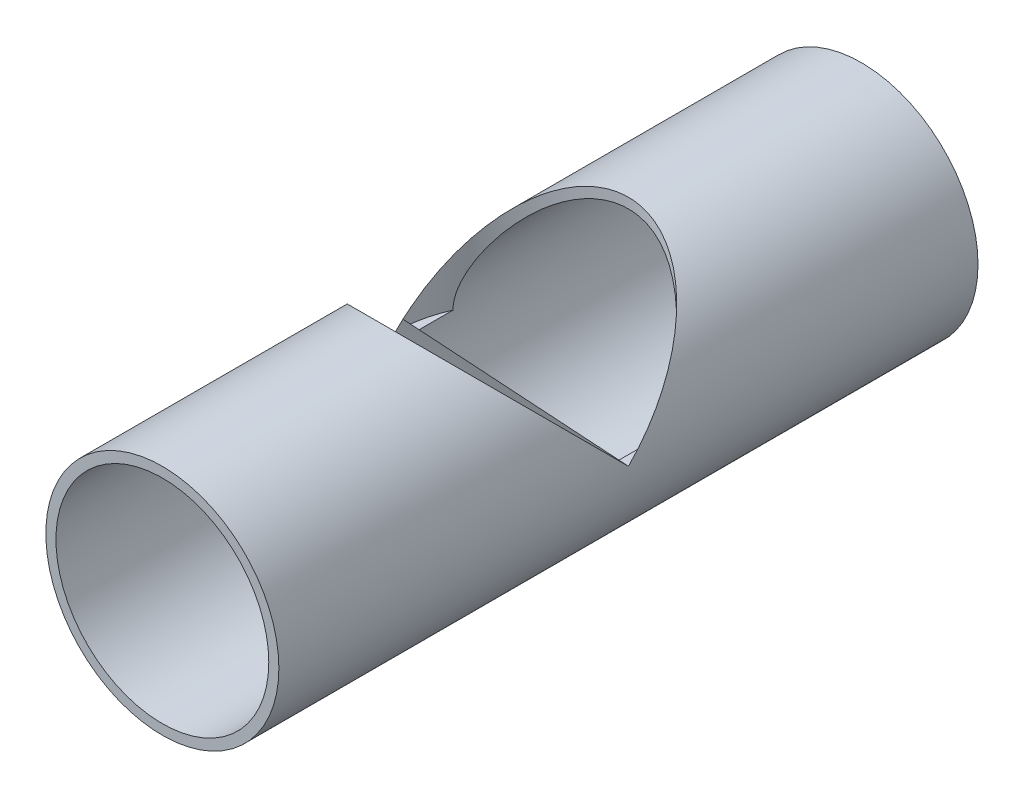
ISO-10303-21;
HEADER;
FILE_DESCRIPTION(('STEP AP214'),'2;1');
FILE_NAME('part.step','',(''),(''),'','','');
FILE_SCHEMA(('AUTOMOTIVE_DESIGN { 1 0 10303 214 1 1 1 1 }'));
ENDSEC;
DATA;
#1=APPLICATION_CONTEXT('core data for automotive mechanical design processes');
#2=APPLICATION_PROTOCOL_DEFINITION('international standard','automotive_design',2000,#1);
#3=PRODUCT_CONTEXT('',#1,'mechanical');
#4=PRODUCT('Part','Part','',(#3));
#5=PRODUCT_RELATED_PRODUCT_CATEGORY('part','',(#4));
#6=PRODUCT_DEFINITION_FORMATION('','',#4);
#7=PRODUCT_DEFINITION_CONTEXT('part definition',#1,'design');
#8=PRODUCT_DEFINITION('design','',#6,#7);
#9=PRODUCT_DEFINITION_SHAPE('','',#8);
#10=(LENGTH_UNIT() NAMED_UNIT(*) SI_UNIT(.MILLI.,.METRE.));
#11=(NAMED_UNIT(*) PLANE_ANGLE_UNIT() SI_UNIT($,.RADIAN.));
#12=(NAMED_UNIT(*) SI_UNIT($,.STERADIAN.) SOLID_ANGLE_UNIT());
#13=UNCERTAINTY_MEASURE_WITH_UNIT(LENGTH_MEASURE(1.E-05),#10,'distance_accuracy_value','');
#14=(GEOMETRIC_REPRESENTATION_CONTEXT(3) GLOBAL_UNCERTAINTY_ASSIGNED_CONTEXT((#13)) GLOBAL_UNIT_ASSIGNED_CONTEXT((#10,
#11,#12)) REPRESENTATION_CONTEXT('',''));
#15=CARTESIAN_POINT('',(0.,0.,0.));
#16=DIRECTION('',(0.,0.,1.));
#17=DIRECTION('',(1.,0.,0.));
#18=AXIS2_PLACEMENT_3D('',#15,#16,#17);
#19=CARTESIAN_POINT('',(0.,0.,57.15));
#20=DIRECTION('',(0.,-1.,0.));
#21=DIRECTION('',(0.,0.,-1.));
#22=AXIS2_PLACEMENT_3D('',#19,#20,#21);
#23=PLANE('',#22);
#24=CARTESIAN_POINT('',(0.,0.,57.15));
#25=DIRECTION('',(0.,1.,0.));
#26=DIRECTION('',(0.,0.,1.));
#27=AXIS2_PLACEMENT_3D('',#24,#25,#26);
#28=CIRCLE('',#27,19.05);
#29=CARTESIAN_POINT('',(-17.399,0.,49.3925971485297));
#30=VERTEX_POINT('',#29);
#31=CARTESIAN_POINT('',(-19.05,0.,57.15));
#32=VERTEX_POINT('',#31);
#33=EDGE_CURVE('E34',#30,#32,#28,.T.);
#34=ORIENTED_EDGE('',*,*,#33,.T.);
#35=CARTESIAN_POINT('',(0.,0.,57.15));
#36=DIRECTION('',(0.,1.,0.));
#37=DIRECTION('',(0.,0.,1.));
#38=AXIS2_PLACEMENT_3D('',#35,#36,#37);
#39=CIRCLE('',#38,19.05);
#40=CARTESIAN_POINT('',(-17.399,0.,64.9074028514703));
#41=VERTEX_POINT('',#40);
#42=EDGE_CURVE('E67',#32,#41,#39,.T.);
#43=ORIENTED_EDGE('',*,*,#42,.T.);
#44=DIRECTION('',(0.,0.,1.));
#45=VECTOR('',#44,1.);
#46=CARTESIAN_POINT('',(-17.399,0.,0.));
#47=LINE('',#46,#45);
#48=EDGE_CURVE('E59',#41,#30,#47,.F.);
#49=ORIENTED_EDGE('',*,*,#48,.T.);
#50=EDGE_LOOP('',(#34,#43,#49));
#51=FACE_BOUND('',#50,.T.);
#52=ADVANCED_FACE('F17',(#51),#23,.F.);
#53=CARTESIAN_POINT('',(0.,0.,57.15));
#54=DIRECTION('',(0.,-1.,0.));
#55=DIRECTION('',(0.,0.,-1.));
#56=AXIS2_PLACEMENT_3D('',#53,#54,#55);
#57=PLANE('',#56);
#58=CARTESIAN_POINT('',(0.,0.,57.15));
#59=DIRECTION('',(0.,1.,0.));
#60=DIRECTION('',(0.,0.,1.));
#61=AXIS2_PLACEMENT_3D('',#58,#59,#60);
#62=CIRCLE('',#61,19.05);
#63=CARTESIAN_POINT('',(17.399,0.,64.9074028514703));
#64=VERTEX_POINT('',#63);
#65=CARTESIAN_POINT('',(19.05,0.,57.15));
#66=VERTEX_POINT('',#65);
#67=EDGE_CURVE('E52',#64,#66,#62,.T.);
#68=ORIENTED_EDGE('',*,*,#67,.T.);
#69=CARTESIAN_POINT('',(0.,0.,57.15));
#70=DIRECTION('',(0.,1.,0.));
#71=DIRECTION('',(0.,0.,1.));
#72=AXIS2_PLACEMENT_3D('',#69,#70,#71);
#73=CIRCLE('',#72,19.05);
#74=CARTESIAN_POINT('',(17.399,0.,49.3925971485297));
#75=VERTEX_POINT('',#74);
#76=EDGE_CURVE('E55',#66,#75,#73,.T.);
#77=ORIENTED_EDGE('',*,*,#76,.T.);
#78=DIRECTION('',(0.,0.,1.));
#79=VECTOR('',#78,1.);
#80=CARTESIAN_POINT('',(17.399,0.,0.));
#81=LINE('',#80,#79);
#82=EDGE_CURVE('E48',#75,#64,#81,.T.);
#83=ORIENTED_EDGE('',*,*,#82,.T.);
#84=EDGE_LOOP('',(#68,#77,#83));
#85=FACE_BOUND('',#84,.T.);
#86=ADVANCED_FACE('F50',(#85),#57,.F.);
#87=CARTESIAN_POINT('',(0.,0.,0.));
#88=DIRECTION('',(0.,0.,1.));
#89=DIRECTION('',(1.,0.,0.));
#90=AXIS2_PLACEMENT_3D('',#87,#88,#89);
#91=CYLINDRICAL_SURFACE('',#90,17.399);
#92=CARTESIAN_POINT('',(0.,0.,0.));
#93=DIRECTION('',(0.,0.,1.));
#94=DIRECTION('',(1.,0.,0.));
#95=AXIS2_PLACEMENT_3D('',#92,#93,#94);
#96=CIRCLE('',#95,17.399);
#97=CARTESIAN_POINT('',(17.399,0.,0.));
#98=VERTEX_POINT('',#97);
#99=EDGE_CURVE('E115',#98,#98,#96,.T.);
#100=ORIENTED_EDGE('',*,*,#99,.F.);
#101=EDGE_LOOP('',(#100));
#102=FACE_BOUND('',#101,.T.);
#103=ORIENTED_EDGE('',*,*,#48,.F.);
#104=CARTESIAN_POINT('',(-17.399,0.,64.9074028514703));
#105=CARTESIAN_POINT('',(-17.3990027926557,0.126619411653412,64.9073892806763));
#106=CARTESIAN_POINT('',(-17.3976172953479,0.253213422142252,64.91050481767));
#107=CARTESIAN_POINT('',(-17.3920993093259,0.506011561056938,64.9228663106787));
#108=CARTESIAN_POINT('',(-17.3879674951789,0.632215777580591,64.9321107612707));
#109=CARTESIAN_POINT('',(-17.3715310393773,1.00902330778525,64.9687698671014));
#110=CARTESIAN_POINT('',(-17.3551849725285,1.25863541656879,65.005111937121));
#111=CARTESIAN_POINT('',(-17.3126787054344,1.74803233786395,65.0983443626753));
#112=CARTESIAN_POINT('',(-17.2867118539878,1.98791378893045,65.1548291232535));
#113=CARTESIAN_POINT('',(-17.2256220476168,2.4617617860572,65.2854561488629));
#114=CARTESIAN_POINT('',(-17.1904915826852,2.69572330712606,65.3596128925784));
#115=CARTESIAN_POINT('',(-17.0914704002142,3.27608545997221,65.5644416491115));
#116=CARTESIAN_POINT('',(-17.0220928683165,3.6182148201961,65.7045314532728));
#117=CARTESIAN_POINT('',(-16.8659507450822,4.2875618159471,66.008409139202));
#118=CARTESIAN_POINT('',(-16.7791763237468,4.6147708919803,66.1722104043654));
#119=CARTESIAN_POINT('',(-16.5885907607409,5.25908025866418,66.5180621575718));
#120=CARTESIAN_POINT('',(-16.4846028375362,5.57602990071133,66.7002934483331));
#121=CARTESIAN_POINT('',(-16.2611162606568,6.19761374754541,67.0760481170756));
#122=CARTESIAN_POINT('',(-16.1416117153161,6.50224321644266,67.2695757688457));
#123=CARTESIAN_POINT('',(-15.9012328343761,7.0682446326165,67.6427199440383));
#124=CARTESIAN_POINT('',(-15.7818795075659,7.33075234639333,67.8216028930283));
#125=CARTESIAN_POINT('',(-15.531375280231,7.84755054304734,68.1830066315397));
#126=CARTESIAN_POINT('',(-15.4002228366692,8.10183994524195,68.3655278944272));
#127=CARTESIAN_POINT('',(-15.1261173325553,8.60275103720113,68.7325543909568));
#128=CARTESIAN_POINT('',(-14.9831580377589,8.84936858024162,68.9170606274058));
#129=CARTESIAN_POINT('',(-14.6854749405307,9.33504840785214,69.2865419716062));
#130=CARTESIAN_POINT('',(-14.5307500246226,9.57410997430043,69.4715171221294));
#131=CARTESIAN_POINT('',(-14.0499414824725,10.2784757466186,70.023976753931));
#132=CARTESIAN_POINT('',(-13.706221982577,10.7327911450247,70.3903569500405));
#133=CARTESIAN_POINT('',(-12.9709988366539,11.6105902831832,71.1114056628348));
#134=CARTESIAN_POINT('',(-12.5795204493307,12.0340901330639,71.4660802453506));
#135=CARTESIAN_POINT('',(-11.8513027830295,12.7460780346226,72.0702493412787));
#136=CARTESIAN_POINT('',(-11.5252152004648,13.0419213680792,72.32393857843));
#137=CARTESIAN_POINT('',(-10.8451357651757,13.6126880208168,72.8172254345686));
#138=CARTESIAN_POINT('',(-10.4911442114866,13.8876115642246,73.0568232045201));
#139=CARTESIAN_POINT('',(-9.7556464324253,14.4137713143204,73.5182053590736));
#140=CARTESIAN_POINT('',(-9.37416774185507,14.6650306596365,73.7400071123435));
#141=CARTESIAN_POINT('',(-8.58390774378864,15.1411487148883,74.1623369264844));
#142=CARTESIAN_POINT('',(-8.17513251731963,15.3660132743823,74.3628696999896));
#143=CARTESIAN_POINT('',(-7.41609675759786,15.7438449488538,74.7010787980119));
#144=CARTESIAN_POINT('',(-7.07052907343838,15.9021892450143,74.8432976749746));
#145=CARTESIAN_POINT('',(-6.36382451687045,16.1979501260028,75.1095864108884));
#146=CARTESIAN_POINT('',(-6.00269106933714,16.3353712846128,75.2336602360993));
#147=CARTESIAN_POINT('',(-5.26647789377184,16.5873660705375,75.4616118596446));
#148=CARTESIAN_POINT('',(-4.89140366751787,16.7019485999545,75.5654975265765));
#149=CARTESIAN_POINT('',(-4.12923028647436,16.9065171053999,75.751230625274));
#150=CARTESIAN_POINT('',(-3.74213100127715,16.9965028145804,75.8330778179467));
#151=CARTESIAN_POINT('',(-2.95593537190508,17.1507769807365,75.9735337773239));
#152=CARTESIAN_POINT('',(-2.55677683000924,17.2148923872178,76.0319860313285));
#153=CARTESIAN_POINT('',(-1.75207798329658,17.3153056168189,76.1235785556383));
#154=CARTESIAN_POINT('',(-1.34653766138736,17.3516033654214,76.1567187581382));
#155=CARTESIAN_POINT('',(-0.532740871466237,17.3956140232931,76.1969054092446));
#156=CARTESIAN_POINT('',(-0.124485289769641,17.4033358417348,76.2039599906146));
#157=CARTESIAN_POINT('',(0.691145635542898,17.3900500247943,76.1918258138202));
#158=CARTESIAN_POINT('',(1.09852104488591,17.3690446145166,76.17263908821));
#159=CARTESIAN_POINT('',(1.86650740664488,17.3024305274246,76.1118364386318));
#160=CARTESIAN_POINT('',(2.22756908470294,17.2596128163397,76.0727652631555));
#161=CARTESIAN_POINT('',(2.94361664813322,17.1520079260685,75.9746695916722));
#162=CARTESIAN_POINT('',(3.2986030444039,17.0872226038712,75.9156467822389));
#163=CARTESIAN_POINT('',(4.00038341779028,16.9366748894927,75.7786682489914));
#164=CARTESIAN_POINT('',(4.34717668373007,16.8509106835957,75.700710888207));
#165=CARTESIAN_POINT('',(5.03073264287059,16.65961931318,75.5271216594109));
#166=CARTESIAN_POINT('',(5.36749474073483,16.5540909783843,75.4314887447959));
#167=CARTESIAN_POINT('',(6.04508836894759,16.319211609248,75.2190712727942));
#168=CARTESIAN_POINT('',(6.38536566225002,16.1889732182397,75.1015031398445));
#169=CARTESIAN_POINT('',(7.05200979717744,15.9099012910429,74.8502421296737));
#170=CARTESIAN_POINT('',(7.37837661185775,15.7610677188377,74.7165492212207));
#171=CARTESIAN_POINT('',(8.01637955747604,15.4463398391999,74.4347274052077));
#172=CARTESIAN_POINT('',(8.32801263159099,15.2804420139058,74.2865955213283));
#173=CARTESIAN_POINT('',(8.93593865373799,14.9330779736276,73.9775912941988));
#174=CARTESIAN_POINT('',(9.23222831724047,14.751608447154,73.8167162415391));
#175=CARTESIAN_POINT('',(9.96108070114769,14.2751141336036,73.39616265681));
#176=CARTESIAN_POINT('',(10.3832304302346,13.9706188807904,73.1290705087056));
#177=CARTESIAN_POINT('',(11.1906483352997,13.3326512383542,72.5743967388524));
#178=CARTESIAN_POINT('',(11.5758996118658,12.9991657033674,72.2868058328948));
#179=CARTESIAN_POINT('',(12.3107246973626,12.3055766392129,71.6954983316236));
#180=CARTESIAN_POINT('',(12.6601983724747,11.9454030182208,71.3917399093147));
#181=CARTESIAN_POINT('',(13.3228256699068,11.2015895641249,70.7738744147983));
#182=CARTESIAN_POINT('',(13.6359864105728,10.8179543527437,70.4597693863683));
#183=CARTESIAN_POINT('',(14.2338486111263,10.0188698517803,69.8187294700677));
#184=CARTESIAN_POINT('',(14.517686463156,9.60287793519724,69.4916676006417));
#185=CARTESIAN_POINT('',(15.0487827113267,8.74718214020968,68.838186754623));
#186=CARTESIAN_POINT('',(15.296023432836,8.30746694358544,68.5117681633014));
#187=CARTESIAN_POINT('',(15.6391176739874,7.6293606590487,68.0293160856903));
#188=CARTESIAN_POINT('',(15.7488029782035,7.40036468575161,67.869778727444));
#189=CARTESIAN_POINT('',(15.9589029321096,6.9356804418858,67.5544108647403));
#190=CARTESIAN_POINT('',(16.0593187405627,6.69999301263363,67.3985798987662));
#191=CARTESIAN_POINT('',(16.25064002581,6.22159236078595,67.0924221698046));
#192=CARTESIAN_POINT('',(16.3415534376162,5.97888521981352,66.9420908835962));
#193=CARTESIAN_POINT('',(16.5136633013956,5.48564865833397,66.6489623035712));
#194=CARTESIAN_POINT('',(16.5948621460068,5.23512118317328,66.5061631594989));
#195=CARTESIAN_POINT('',(16.7399044598348,4.74960595279282,66.2438654480011));
#196=CARTESIAN_POINT('',(16.8046633839798,4.51539494834859,66.1234411407302));
#197=CARTESIAN_POINT('',(16.9253972886873,4.03935876063698,65.8935847674936));
#198=CARTESIAN_POINT('',(16.981371807116,3.79753317758156,65.784153279952));
#199=CARTESIAN_POINT('',(17.0835577011958,3.30749209621931,65.5801538563993));
#200=CARTESIAN_POINT('',(17.1298288043977,3.05932691299981,65.4854959663158));
#201=CARTESIAN_POINT('',(17.2122316312634,2.55526916443492,65.3139853899444));
#202=CARTESIAN_POINT('',(17.2483680118588,2.29938020825195,65.2371245287159));
#203=CARTESIAN_POINT('',(17.2984619179857,1.87510757973664,65.1292141352051));
#204=CARTESIAN_POINT('',(17.3157056836072,1.70875077851934,65.0916704239793));
#205=CARTESIAN_POINT('',(17.3454986249527,1.37373521286453,65.0263862190104));
#206=CARTESIAN_POINT('',(17.35804919276,1.20507714643118,64.9986428184619));
#207=CARTESIAN_POINT('',(17.3783689967595,0.86423619591593,64.9535535854909));
#208=CARTESIAN_POINT('',(17.386085725966,0.692034904492633,64.9363219871161));
#209=CARTESIAN_POINT('',(17.3964114605965,0.34656692612635,64.9132082062703));
#210=CARTESIAN_POINT('',(17.3990157927525,0.173299409508221,64.9073364079205));
#211=CARTESIAN_POINT('',(17.399,0.,64.9074028514704));
#212=B_SPLINE_CURVE_WITH_KNOTS('',3,(#104,#105,#106,#107,#108,#109,#110,#111,#112,#113,#114,
#115,#116,#117,#118,#119,#120,#121,#122,#123,#124,#125,#126,#127,#128,#129,#130,#131,#132,#133,
#134,#135,#136,#137,#138,#139,#140,#141,#142,#143,#144,#145,#146,#147,#148,#149,#150,#151,#152,
#153,#154,#155,#156,#157,#158,#159,#160,#161,#162,#163,#164,#165,#166,#167,#168,#169,#170,#171,
#172,#173,#174,#175,#176,#177,#178,#179,#180,#181,#182,#183,#184,#185,#186,#187,#188,#189,#190,
#191,#192,#193,#194,#195,#196,#197,#198,#199,#200,#201,#202,#203,#204,#205,#206,#207,#208,#209,
#210,#211),.UNSPECIFIED.,.F.,.F.,(4,2,2,2,2,2,2,2,2,2,2,2,2,2,2,2,2,2,2,2,2,2,2,2,2,2,2,2,2,2,2,
2,2,2,2,2,2,2,2,2,2,2,2,2,2,2,2,2,2,2,2,2,2,4),(0.,0.379764092853833,0.759434940165909,
1.51634726991587,2.25880724087371,3.00187761458816,4.12835037763912,5.25546144985719,
6.3949616034871,7.53489569789875,8.55259337985784,9.57042434587642,10.5887962249633,
11.6072646010801,13.6367495933949,15.6651658480776,17.1883664070907,18.71155064481,
20.2332297195439,21.754570923617,22.9709961355442,24.187155054878,25.4028390055058,
26.6185361444175,27.8422355786928,29.0659382909752,30.2892594549617,31.5124858703965,
32.608284333679,33.7039901888642,34.7997908060849,35.8956563285599,37.043090764153,
38.1905274222329,39.3382011047017,40.4861194600479,42.2386035757021,43.991886525206,
45.749949583538,47.5076674278728,49.3075787665061,51.1083565581974,52.0077767250255,
52.9070843042516,53.8056348105301,54.7039635517724,55.5171752742101,56.3304297641096,
57.1385211097759,57.9462405247013,58.4601584642904,58.9739238458356,59.4931773421597,
60.0129052701034),.UNSPECIFIED.);
#213=EDGE_CURVE('E63',#41,#64,#212,.T.);
#214=ORIENTED_EDGE('',*,*,#213,.T.);
#215=ORIENTED_EDGE('',*,*,#82,.F.);
#216=CARTESIAN_POINT('',(17.399,0.,49.3925971485297));
#217=CARTESIAN_POINT('',(17.3990027926557,0.12661941165341,49.3926107193237));
#218=CARTESIAN_POINT('',(17.3976172953479,0.25321342214225,49.38949518233));
#219=CARTESIAN_POINT('',(17.3920993093259,0.506011561056936,49.3771336893213));
#220=CARTESIAN_POINT('',(17.3879674951789,0.632215777580588,49.3678892387293));
#221=CARTESIAN_POINT('',(17.3715310393773,1.00902330778525,49.3312301328986));
#222=CARTESIAN_POINT('',(17.3551849725285,1.25863541656879,49.294888062879));
#223=CARTESIAN_POINT('',(17.3126787054344,1.74803233786395,49.2016556373247));
#224=CARTESIAN_POINT('',(17.2867118539878,1.98791378893046,49.1451708767465));
#225=CARTESIAN_POINT('',(17.2256220476168,2.4617617860572,49.0145438511371));
#226=CARTESIAN_POINT('',(17.1904915826852,2.69572330712607,48.9403871074216));
#227=CARTESIAN_POINT('',(17.0914704002142,3.2760854599722,48.7355583508885));
#228=CARTESIAN_POINT('',(17.0220928683165,3.6182148201961,48.5954685467272));
#229=CARTESIAN_POINT('',(16.8659507450822,4.28756181594711,48.291590860798));
#230=CARTESIAN_POINT('',(16.7791763237468,4.6147708919803,48.1277895956346));
#231=CARTESIAN_POINT('',(16.5885907607409,5.25908025866418,47.7819378424282));
#232=CARTESIAN_POINT('',(16.4846028375362,5.57602990071133,47.5997065516669));
#233=CARTESIAN_POINT('',(16.2611162606568,6.19761374754541,47.2239518829244));
#234=CARTESIAN_POINT('',(16.1416117153161,6.50224321644265,47.0304242311543));
#235=CARTESIAN_POINT('',(15.9012328343761,7.06824463261649,46.6572800559617));
#236=CARTESIAN_POINT('',(15.7818795075659,7.33075234639333,46.4783971069717));
#237=CARTESIAN_POINT('',(15.531375280231,7.84755054304734,46.1169933684603));
#238=CARTESIAN_POINT('',(15.4002228366692,8.10183994524193,45.9344721055728));
#239=CARTESIAN_POINT('',(15.1261173325553,8.60275103720112,45.5674456090432));
#240=CARTESIAN_POINT('',(14.9831580377589,8.84936858024161,45.3829393725942));
#241=CARTESIAN_POINT('',(14.6854749405307,9.33504840785213,45.0134580283939));
#242=CARTESIAN_POINT('',(14.5307500246226,9.57410997430042,44.8284828778707));
#243=CARTESIAN_POINT('',(14.0499414824725,10.2784757466186,44.276023246069));
#244=CARTESIAN_POINT('',(13.706221982577,10.7327911450247,43.9096430499595));
#245=CARTESIAN_POINT('',(12.9709988366539,11.6105902831832,43.1885943371652));
#246=CARTESIAN_POINT('',(12.5795204493307,12.0340901330639,42.8339197546494));
#247=CARTESIAN_POINT('',(11.8513027830295,12.7460780346226,42.2297506587214));
#248=CARTESIAN_POINT('',(11.5252152004648,13.0419213680792,41.97606142157));
#249=CARTESIAN_POINT('',(10.8451357651757,13.6126880208168,41.4827745654314));
#250=CARTESIAN_POINT('',(10.4911442114866,13.8876115642246,41.2431767954799));
#251=CARTESIAN_POINT('',(9.7556464324253,14.4137713143204,40.7817946409264));
#252=CARTESIAN_POINT('',(9.37416774185507,14.6650306596365,40.5599928876565));
#253=CARTESIAN_POINT('',(8.58390774378864,15.1411487148883,40.1376630735156));
#254=CARTESIAN_POINT('',(8.17513251731962,15.3660132743823,39.9371303000104));
#255=CARTESIAN_POINT('',(7.41609675759786,15.7438449488538,39.5989212019881));
#256=CARTESIAN_POINT('',(7.07052907343837,15.9021892450143,39.4567023250254));
#257=CARTESIAN_POINT('',(6.36382451687044,16.1979501260028,39.1904135891116));
#258=CARTESIAN_POINT('',(6.00269106933713,16.3353712846128,39.0663397639007));
#259=CARTESIAN_POINT('',(5.26647789377183,16.5873660705375,38.8383881403555));
#260=CARTESIAN_POINT('',(4.89140366751786,16.7019485999545,38.7345024734235));
#261=CARTESIAN_POINT('',(4.12923028647435,16.9065171053999,38.548769374726));
#262=CARTESIAN_POINT('',(3.74213100127715,16.9965028145804,38.4669221820533));
#263=CARTESIAN_POINT('',(2.95593537190507,17.1507769807365,38.3264662226761));
#264=CARTESIAN_POINT('',(2.55677683000923,17.2148923872178,38.2680139686715));
#265=CARTESIAN_POINT('',(1.75207798329657,17.3153056168189,38.1764214443617));
#266=CARTESIAN_POINT('',(1.34653766138735,17.3516033654214,38.1432812418618));
#267=CARTESIAN_POINT('',(0.532740871466227,17.3956140232931,38.1030945907555));
#268=CARTESIAN_POINT('',(0.124485289769633,17.4033358417348,38.0960400093854));
#269=CARTESIAN_POINT('',(-0.691145635542906,17.3900500247943,38.1081741861798));
#270=CARTESIAN_POINT('',(-1.09852104488592,17.3690446145166,38.12736091179));
#271=CARTESIAN_POINT('',(-1.86650740664489,17.3024305274246,38.1881635613682));
#272=CARTESIAN_POINT('',(-2.22756908470294,17.2596128163397,38.2272347368446));
#273=CARTESIAN_POINT('',(-2.94361664813322,17.1520079260685,38.3253304083278));
#274=CARTESIAN_POINT('',(-3.2986030444039,17.0872226038712,38.3843532177611));
#275=CARTESIAN_POINT('',(-4.00038341779028,16.9366748894927,38.5213317510087));
#276=CARTESIAN_POINT('',(-4.34717668373008,16.8509106835957,38.5992891117931));
#277=CARTESIAN_POINT('',(-5.0307326428706,16.65961931318,38.7728783405891));
#278=CARTESIAN_POINT('',(-5.36749474073484,16.5540909783843,38.8685112552042));
#279=CARTESIAN_POINT('',(-6.04508836894759,16.319211609248,39.0809287272059));
#280=CARTESIAN_POINT('',(-6.38536566225003,16.1889732182396,39.1984968601555));
#281=CARTESIAN_POINT('',(-7.05200979717745,15.9099012910429,39.4497578703263));
#282=CARTESIAN_POINT('',(-7.37837661185776,15.7610677188377,39.5834507787793));
#283=CARTESIAN_POINT('',(-8.01637955747605,15.4463398391999,39.8652725947923));
#284=CARTESIAN_POINT('',(-8.32801263159099,15.2804420139058,40.0134044786717));
#285=CARTESIAN_POINT('',(-8.93593865373799,14.9330779736276,40.3224087058013));
#286=CARTESIAN_POINT('',(-9.23222831724047,14.751608447154,40.4832837584609));
#287=CARTESIAN_POINT('',(-9.9610807011477,14.2751141336036,40.90383734319));
#288=CARTESIAN_POINT('',(-10.3832304302346,13.9706188807904,41.1709294912944));
#289=CARTESIAN_POINT('',(-11.1906483352997,13.3326512383542,41.7256032611476));
#290=CARTESIAN_POINT('',(-11.5758996118658,12.9991657033674,42.0131941671052));
#291=CARTESIAN_POINT('',(-12.3107246973626,12.3055766392129,42.6045016683764));
#292=CARTESIAN_POINT('',(-12.6601983724747,11.9454030182208,42.9082600906854));
#293=CARTESIAN_POINT('',(-13.3228256699068,11.2015895641249,43.5261255852017));
#294=CARTESIAN_POINT('',(-13.6359864105728,10.8179543527437,43.8402306136318));
#295=CARTESIAN_POINT('',(-14.2338486111263,10.0188698517803,44.4812705299324));
#296=CARTESIAN_POINT('',(-14.517686463156,9.60287793519723,44.8083323993583));
#297=CARTESIAN_POINT('',(-15.0487827113267,8.74718214020968,45.461813245377));
#298=CARTESIAN_POINT('',(-15.296023432836,8.30746694358544,45.7882318366987));
#299=CARTESIAN_POINT('',(-15.6391176739874,7.6293606590487,46.2706839143097));
#300=CARTESIAN_POINT('',(-15.7488029782035,7.40036468575161,46.430221272556));
#301=CARTESIAN_POINT('',(-15.9589029321096,6.93568044188581,46.7455891352597));
#302=CARTESIAN_POINT('',(-16.0593187405627,6.69999301263364,46.9014201012338));
#303=CARTESIAN_POINT('',(-16.25064002581,6.22159236078596,47.2075778301954));
#304=CARTESIAN_POINT('',(-16.3415534376162,5.97888521981353,47.3579091164038));
#305=CARTESIAN_POINT('',(-16.5136633013956,5.48564865833398,47.6510376964288));
#306=CARTESIAN_POINT('',(-16.5948621460068,5.23512118317328,47.7938368405011));
#307=CARTESIAN_POINT('',(-16.7399044598348,4.74960595279281,48.0561345519989));
#308=CARTESIAN_POINT('',(-16.8046633839798,4.51539494834858,48.1765588592699));
#309=CARTESIAN_POINT('',(-16.9253972886873,4.03935876063698,48.4064152325064));
#310=CARTESIAN_POINT('',(-16.981371807116,3.79753317758156,48.515846720048));
#311=CARTESIAN_POINT('',(-17.0835577011958,3.30749209621931,48.7198461436007));
#312=CARTESIAN_POINT('',(-17.1298288043977,3.05932691299981,48.8145040336842));
#313=CARTESIAN_POINT('',(-17.2122316312634,2.55526916443492,48.9860146100556));
#314=CARTESIAN_POINT('',(-17.2483680118588,2.29938020825194,49.0628754712841));
#315=CARTESIAN_POINT('',(-17.2984619179858,1.87510757973663,49.1707858647949));
#316=CARTESIAN_POINT('',(-17.3157056836072,1.70875077851933,49.2083295760207));
#317=CARTESIAN_POINT('',(-17.3454986249527,1.37373521286453,49.2736137809896));
#318=CARTESIAN_POINT('',(-17.35804919276,1.20507714643118,49.3013571815381));
#319=CARTESIAN_POINT('',(-17.3783689967595,0.864236195915931,49.3464464145092));
#320=CARTESIAN_POINT('',(-17.386085725966,0.692034904492635,49.3636780128839));
#321=CARTESIAN_POINT('',(-17.3964114605965,0.346566926126353,49.3867917937297));
#322=CARTESIAN_POINT('',(-17.3990157927525,0.173299409508221,49.3926635920795));
#323=CARTESIAN_POINT('',(-17.399,0.,49.3925971485297));
#324=B_SPLINE_CURVE_WITH_KNOTS('',3,(#216,#217,#218,#219,#220,#221,#222,#223,#224,#225,#226,
#227,#228,#229,#230,#231,#232,#233,#234,#235,#236,#237,#238,#239,#240,#241,#242,#243,#244,#245,
#246,#247,#248,#249,#250,#251,#252,#253,#254,#255,#256,#257,#258,#259,#260,#261,#262,#263,#264,
#265,#266,#267,#268,#269,#270,#271,#272,#273,#274,#275,#276,#277,#278,#279,#280,#281,#282,#283,
#284,#285,#286,#287,#288,#289,#290,#291,#292,#293,#294,#295,#296,#297,#298,#299,#300,#301,#302,
#303,#304,#305,#306,#307,#308,#309,#310,#311,#312,#313,#314,#315,#316,#317,#318,#319,#320,#321,
#322,#323),.UNSPECIFIED.,.F.,.F.,(4,2,2,2,2,2,2,2,2,2,2,2,2,2,2,2,2,2,2,2,2,2,2,2,2,2,2,2,2,2,2,
2,2,2,2,2,2,2,2,2,2,2,2,2,2,2,2,2,2,2,2,2,2,4),(0.,0.379764092853832,0.759434940165908,
1.51634726991587,2.25880724087371,3.00187761458816,4.12835037763912,5.25546144985719,
6.39496160348711,7.53489569789875,8.55259337985783,9.57042434587641,10.5887962249633,
11.6072646010801,13.6367495933949,15.6651658480776,17.1883664070907,18.71155064481,
20.2332297195439,21.754570923617,22.9709961355442,24.187155054878,25.4028390055058,
26.6185361444175,27.8422355786928,29.0659382909752,30.2892594549617,31.5124858703965,
32.608284333679,33.7039901888642,34.7997908060849,35.8956563285599,37.043090764153,
38.1905274222329,39.3382011047017,40.4861194600479,42.2386035757021,43.991886525206,
45.749949583538,47.5076674278728,49.3075787665061,51.1083565581975,52.0077767250255,
52.9070843042516,53.8056348105302,54.7039635517725,55.5171752742101,56.3304297641096,
57.1385211097759,57.9462405247014,58.4601584642904,58.9739238458356,59.4931773421598,
60.0129052701035),.UNSPECIFIED.);
#325=EDGE_CURVE('E119',#75,#30,#324,.T.);
#326=ORIENTED_EDGE('',*,*,#325,.T.);
#327=EDGE_LOOP('',(#103,#214,#215,#326));
#328=FACE_BOUND('',#327,.T.);
#329=CARTESIAN_POINT('',(0.,0.,114.3));
#330=DIRECTION('',(0.,0.,1.));
#331=DIRECTION('',(1.,0.,0.));
#332=AXIS2_PLACEMENT_3D('',#329,#330,#331);
#333=CIRCLE('',#332,17.399);
#334=CARTESIAN_POINT('',(17.399,0.,114.3));
#335=VERTEX_POINT('',#334);
#336=EDGE_CURVE('E20',#335,#335,#333,.T.);
#337=ORIENTED_EDGE('',*,*,#336,.T.);
#338=EDGE_LOOP('',(#337));
#339=FACE_BOUND('',#338,.T.);
#340=ADVANCED_FACE('F64',(#102,#328,#339),#91,.F.);
#341=CARTESIAN_POINT('',(0.,0.,114.3));
#342=DIRECTION('',(0.,0.,-1.));
#343=DIRECTION('',(-1.,0.,0.));
#344=AXIS2_PLACEMENT_3D('',#341,#342,#343);
#345=PLANE('',#344);
#346=ORIENTED_EDGE('',*,*,#336,.F.);
#347=EDGE_LOOP('',(#346));
#348=FACE_BOUND('',#347,.T.);
#349=CARTESIAN_POINT('',(0.,0.,114.3));
#350=DIRECTION('',(0.,0.,1.));
#351=DIRECTION('',(1.,0.,0.));
#352=AXIS2_PLACEMENT_3D('',#349,#350,#351);
#353=CIRCLE('',#352,19.05);
#354=CARTESIAN_POINT('',(19.05,0.,114.3));
#355=VERTEX_POINT('',#354);
#356=EDGE_CURVE('E114',#355,#355,#353,.F.);
#357=ORIENTED_EDGE('',*,*,#356,.F.);
#358=EDGE_LOOP('',(#357));
#359=FACE_BOUND('',#358,.T.);
#360=ADVANCED_FACE('F87',(#348,#359),#345,.F.);
#361=CARTESIAN_POINT('',(0.,0.,57.15));
#362=DIRECTION('',(0.,1.,0.));
#363=DIRECTION('',(0.,0.,1.));
#364=AXIS2_PLACEMENT_3D('',#361,#362,#363);
#365=CYLINDRICAL_SURFACE('',#364,19.05);
#366=ORIENTED_EDGE('',*,*,#42,.F.);
#367=CARTESIAN_POINT('',(0.,0.,57.15));
#368=DIRECTION('',(0.,-0.707106781186547,0.707106781186547));
#369=DIRECTION('',(0.,0.707106781186547,0.707106781186547));
#370=AXIS2_PLACEMENT_3D('',#367,#368,#369);
#371=ELLIPSE('',#370,26.9407683632075,19.05);
#372=EDGE_CURVE('E71',#66,#32,#371,.T.);
#373=ORIENTED_EDGE('',*,*,#372,.F.);
#374=ORIENTED_EDGE('',*,*,#67,.F.);
#375=ORIENTED_EDGE('',*,*,#213,.F.);
#376=EDGE_LOOP('',(#366,#373,#374,#375));
#377=FACE_BOUND('',#376,.T.);
#378=ADVANCED_FACE('F69',(#377),#365,.F.);
#379=CARTESIAN_POINT('',(0.,0.,57.15));
#380=DIRECTION('',(0.,1.,0.));
#381=DIRECTION('',(0.,0.,1.));
#382=AXIS2_PLACEMENT_3D('',#379,#380,#381);
#383=CYLINDRICAL_SURFACE('',#382,19.05);
#384=ORIENTED_EDGE('',*,*,#76,.F.);
#385=CARTESIAN_POINT('',(0.,0.,57.15));
#386=DIRECTION('',(0.,0.707106781186547,0.707106781186547));
#387=DIRECTION('',(0.,0.707106781186547,-0.707106781186547));
#388=AXIS2_PLACEMENT_3D('',#385,#386,#387);
#389=ELLIPSE('',#388,26.9407683632075,19.05);
#390=EDGE_CURVE('E26',#32,#66,#389,.F.);
#391=ORIENTED_EDGE('',*,*,#390,.F.);
#392=ORIENTED_EDGE('',*,*,#33,.F.);
#393=ORIENTED_EDGE('',*,*,#325,.F.);
#394=EDGE_LOOP('',(#384,#391,#392,#393));
#395=FACE_BOUND('',#394,.T.);
#396=ADVANCED_FACE('F86',(#395),#383,.F.);
#397=CARTESIAN_POINT('',(0.,0.,0.));
#398=DIRECTION('',(0.,0.,-1.));
#399=DIRECTION('',(-1.,0.,0.));
#400=AXIS2_PLACEMENT_3D('',#397,#398,#399);
#401=PLANE('',#400);
#402=ORIENTED_EDGE('',*,*,#99,.T.);
#403=EDGE_LOOP('',(#402));
#404=FACE_BOUND('',#403,.T.);
#405=CARTESIAN_POINT('',(0.,0.,0.));
#406=DIRECTION('',(0.,0.,1.));
#407=DIRECTION('',(1.,0.,0.));
#408=AXIS2_PLACEMENT_3D('',#405,#406,#407);
#409=CIRCLE('',#408,19.05);
#410=CARTESIAN_POINT('',(19.05,0.,0.));
#411=VERTEX_POINT('',#410);
#412=EDGE_CURVE('E11',#411,#411,#409,.T.);
#413=ORIENTED_EDGE('',*,*,#412,.F.);
#414=EDGE_LOOP('',(#413));
#415=FACE_BOUND('',#414,.T.);
#416=ADVANCED_FACE('F101',(#404,#415),#401,.T.);
#417=CARTESIAN_POINT('',(0.,0.,0.));
#418=DIRECTION('',(0.,0.,1.));
#419=DIRECTION('',(1.,0.,0.));
#420=AXIS2_PLACEMENT_3D('',#417,#418,#419);
#421=CYLINDRICAL_SURFACE('',#420,19.05);
#422=ORIENTED_EDGE('',*,*,#412,.T.);
#423=EDGE_LOOP('',(#422));
#424=FACE_BOUND('',#423,.T.);
#425=ORIENTED_EDGE('',*,*,#372,.T.);
#426=ORIENTED_EDGE('',*,*,#390,.T.);
#427=EDGE_LOOP('',(#425,#426));
#428=FACE_BOUND('',#427,.T.);
#429=ORIENTED_EDGE('',*,*,#356,.T.);
#430=EDGE_LOOP('',(#429));
#431=FACE_BOUND('',#430,.T.);
#432=ADVANCED_FACE('F99',(#424,#428,#431),#421,.T.);
#433=CLOSED_SHELL('',(#52,#86,#340,#360,#378,#396,#416,#432));
#434=MANIFOLD_SOLID_BREP('B1',#433);
#435=ADVANCED_BREP_SHAPE_REPRESENTATION('',(#18,#434),#14);
#436=SHAPE_DEFINITION_REPRESENTATION(#9,#435);
ENDSEC;
END-ISO-10303-21;
